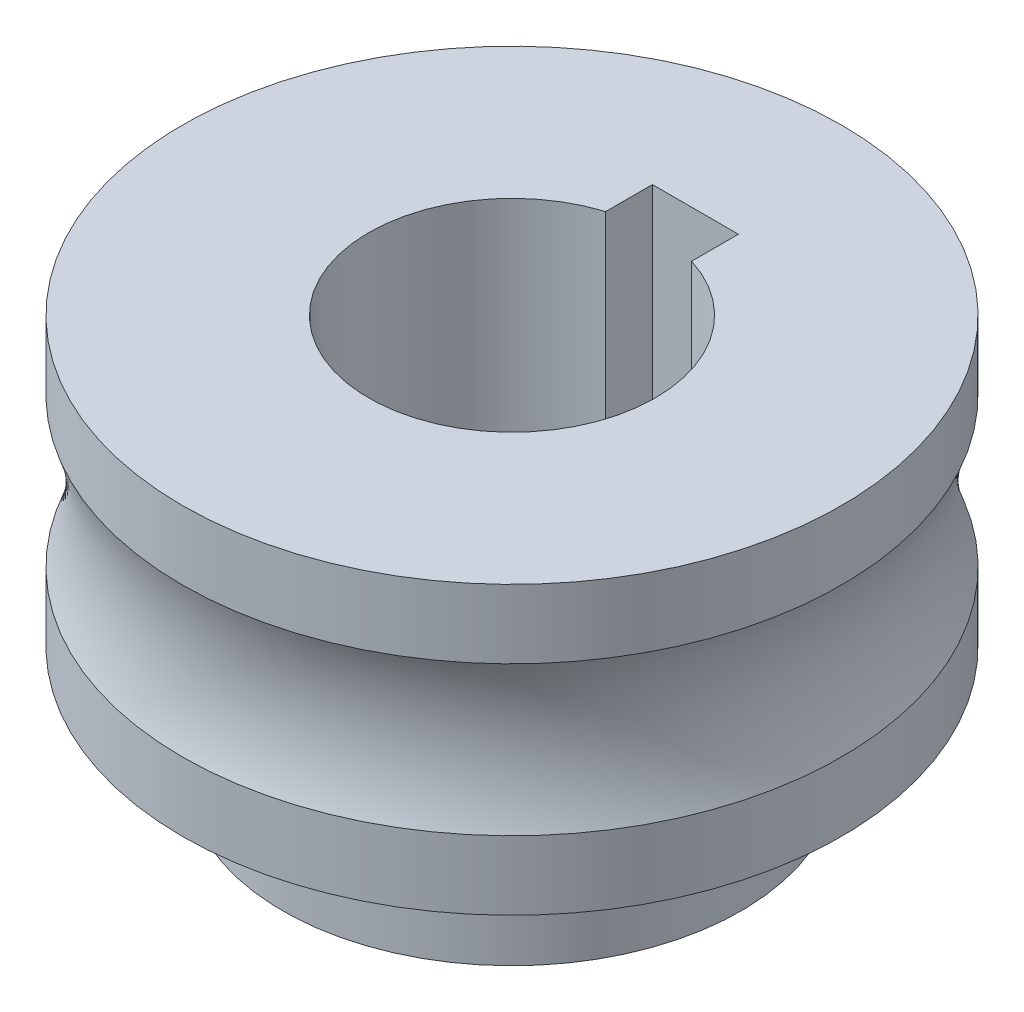
ISO-10303-21;
HEADER;
FILE_DESCRIPTION(('STEP AP214'),'2;1');
FILE_NAME('part.step','',(''),(''),'','','');
FILE_SCHEMA(('AUTOMOTIVE_DESIGN { 1 0 10303 214 1 1 1 1 }'));
ENDSEC;
DATA;
#1=APPLICATION_CONTEXT('core data for automotive mechanical design processes');
#2=APPLICATION_PROTOCOL_DEFINITION('international standard','automotive_design',2000,#1);
#3=PRODUCT_CONTEXT('',#1,'mechanical');
#4=PRODUCT('Part','Part','',(#3));
#5=PRODUCT_RELATED_PRODUCT_CATEGORY('part','',(#4));
#6=PRODUCT_DEFINITION_FORMATION('','',#4);
#7=PRODUCT_DEFINITION_CONTEXT('part definition',#1,'design');
#8=PRODUCT_DEFINITION('design','',#6,#7);
#9=PRODUCT_DEFINITION_SHAPE('','',#8);
#10=(LENGTH_UNIT() NAMED_UNIT(*) SI_UNIT(.MILLI.,.METRE.));
#11=(NAMED_UNIT(*) PLANE_ANGLE_UNIT() SI_UNIT($,.RADIAN.));
#12=(NAMED_UNIT(*) SI_UNIT($,.STERADIAN.) SOLID_ANGLE_UNIT());
#13=UNCERTAINTY_MEASURE_WITH_UNIT(LENGTH_MEASURE(1.E-05),#10,'distance_accuracy_value','');
#14=(GEOMETRIC_REPRESENTATION_CONTEXT(3) GLOBAL_UNCERTAINTY_ASSIGNED_CONTEXT((#13)) GLOBAL_UNIT_ASSIGNED_CONTEXT((#10,
#11,#12)) REPRESENTATION_CONTEXT('',''));
#15=CARTESIAN_POINT('',(0.,0.,0.));
#16=DIRECTION('',(0.,0.,1.));
#17=DIRECTION('',(1.,0.,0.));
#18=AXIS2_PLACEMENT_3D('',#15,#16,#17);
#19=CARTESIAN_POINT('',(0.,-15.,0.));
#20=DIRECTION('',(0.,-1.,0.));
#21=DIRECTION('',(0.,0.,-1.));
#22=AXIS2_PLACEMENT_3D('',#19,#20,#21);
#23=CYLINDRICAL_SURFACE('',#22,5.);
#24=DIRECTION('',(0.,-1.,0.));
#25=VECTOR('',#24,1.);
#26=CARTESIAN_POINT('',(1.5,-15.,-4.76969600708473));
#27=LINE('',#26,#25);
#28=CARTESIAN_POINT('',(1.5,-9.,-4.76969600708473));
#29=VERTEX_POINT('',#28);
#30=CARTESIAN_POINT('',(1.5,5.,-4.76969600708473));
#31=VERTEX_POINT('',#30);
#32=EDGE_CURVE('E69',#29,#31,#27,.F.);
#33=ORIENTED_EDGE('',*,*,#32,.F.);
#34=CARTESIAN_POINT('',(0.,-9.,0.));
#35=DIRECTION('',(0.,-1.,0.));
#36=DIRECTION('',(0.,0.,-1.));
#37=AXIS2_PLACEMENT_3D('',#34,#35,#36);
#38=CIRCLE('',#37,5.);
#39=CARTESIAN_POINT('',(-1.5,-9.,-4.76969600708473));
#40=VERTEX_POINT('',#39);
#41=EDGE_CURVE('E233',#29,#40,#38,.T.);
#42=ORIENTED_EDGE('',*,*,#41,.T.);
#43=DIRECTION('',(0.,-1.,0.));
#44=VECTOR('',#43,1.);
#45=CARTESIAN_POINT('',(-1.5,-15.,-4.76969600708473));
#46=LINE('',#45,#44);
#47=CARTESIAN_POINT('',(-1.5,5.,-4.76969600708473));
#48=VERTEX_POINT('',#47);
#49=EDGE_CURVE('E100',#48,#40,#46,.T.);
#50=ORIENTED_EDGE('',*,*,#49,.F.);
#51=CARTESIAN_POINT('',(0.,5.,0.));
#52=DIRECTION('',(0.,-1.,0.));
#53=DIRECTION('',(0.,0.,-1.));
#54=AXIS2_PLACEMENT_3D('',#51,#52,#53);
#55=CIRCLE('',#54,5.);
#56=EDGE_CURVE('E128',#31,#48,#55,.T.);
#57=ORIENTED_EDGE('',*,*,#56,.F.);
#58=EDGE_LOOP('',(#33,#42,#50,#57));
#59=FACE_BOUND('',#58,.T.);
#60=ADVANCED_FACE('F48',(#59),#23,.F.);
#61=CARTESIAN_POINT('',(0.,-15.,0.));
#62=DIRECTION('',(0.,-1.,0.));
#63=DIRECTION('',(0.,0.,-1.));
#64=AXIS2_PLACEMENT_3D('',#61,#62,#63);
#65=CYLINDRICAL_SURFACE('',#64,8.);
#66=CARTESIAN_POINT('',(0.,-5.,0.));
#67=DIRECTION('',(0.,-1.,0.));
#68=DIRECTION('',(0.,0.,-1.));
#69=AXIS2_PLACEMENT_3D('',#66,#67,#68);
#70=CIRCLE('',#69,8.);
#71=CARTESIAN_POINT('',(0.,-5.,-8.));
#72=VERTEX_POINT('',#71);
#73=EDGE_CURVE('E125',#72,#72,#70,.T.);
#74=ORIENTED_EDGE('',*,*,#73,.T.);
#75=EDGE_LOOP('',(#74));
#76=FACE_BOUND('',#75,.T.);
#77=CARTESIAN_POINT('',(0.,-9.,0.));
#78=DIRECTION('',(0.,-1.,0.));
#79=DIRECTION('',(0.,0.,-1.));
#80=AXIS2_PLACEMENT_3D('',#77,#78,#79);
#81=CIRCLE('',#80,8.);
#82=CARTESIAN_POINT('',(0.,-9.,-8.));
#83=VERTEX_POINT('',#82);
#84=EDGE_CURVE('E101',#83,#83,#81,.F.);
#85=ORIENTED_EDGE('',*,*,#84,.T.);
#86=EDGE_LOOP('',(#85));
#87=FACE_BOUND('',#86,.T.);
#88=ADVANCED_FACE('F148',(#76,#87),#65,.T.);
#89=CARTESIAN_POINT('',(1.5,-15.,-3.6));
#90=DIRECTION('',(1.,0.,0.));
#91=DIRECTION('',(0.,0.,-1.));
#92=AXIS2_PLACEMENT_3D('',#89,#90,#91);
#93=PLANE('',#92);
#94=DIRECTION('',(0.,0.,-1.));
#95=VECTOR('',#94,1.);
#96=CARTESIAN_POINT('',(1.5,-9.,-3.6));
#97=LINE('',#96,#95);
#98=CARTESIAN_POINT('',(1.5,-9.,-6.4));
#99=VERTEX_POINT('',#98);
#100=EDGE_CURVE('E62',#29,#99,#97,.T.);
#101=ORIENTED_EDGE('',*,*,#100,.F.);
#102=ORIENTED_EDGE('',*,*,#32,.T.);
#103=DIRECTION('',(0.,0.,-1.));
#104=VECTOR('',#103,1.);
#105=CARTESIAN_POINT('',(1.5,5.,-3.6));
#106=LINE('',#105,#104);
#107=CARTESIAN_POINT('',(1.5,5.,-6.4));
#108=VERTEX_POINT('',#107);
#109=EDGE_CURVE('E236',#31,#108,#106,.T.);
#110=ORIENTED_EDGE('',*,*,#109,.T.);
#111=DIRECTION('',(0.,1.,0.));
#112=VECTOR('',#111,1.);
#113=CARTESIAN_POINT('',(1.5,-15.,-6.4));
#114=LINE('',#113,#112);
#115=EDGE_CURVE('E107',#99,#108,#114,.T.);
#116=ORIENTED_EDGE('',*,*,#115,.F.);
#117=EDGE_LOOP('',(#101,#102,#110,#116));
#118=FACE_BOUND('',#117,.T.);
#119=ADVANCED_FACE('F153',(#118),#93,.F.);
#120=CARTESIAN_POINT('',(-1.5,-15.,-3.6));
#121=DIRECTION('',(-1.,0.,0.));
#122=DIRECTION('',(0.,0.,1.));
#123=AXIS2_PLACEMENT_3D('',#120,#121,#122);
#124=PLANE('',#123);
#125=DIRECTION('',(0.,0.,1.));
#126=VECTOR('',#125,1.);
#127=CARTESIAN_POINT('',(-1.5,-9.,-3.6));
#128=LINE('',#127,#126);
#129=CARTESIAN_POINT('',(-1.5,-9.,-6.4));
#130=VERTEX_POINT('',#129);
#131=EDGE_CURVE('E89',#130,#40,#128,.T.);
#132=ORIENTED_EDGE('',*,*,#131,.F.);
#133=DIRECTION('',(0.,1.,0.));
#134=VECTOR('',#133,1.);
#135=CARTESIAN_POINT('',(-1.5,-15.,-6.4));
#136=LINE('',#135,#134);
#137=CARTESIAN_POINT('',(-1.5,5.,-6.4));
#138=VERTEX_POINT('',#137);
#139=EDGE_CURVE('E97',#130,#138,#136,.T.);
#140=ORIENTED_EDGE('',*,*,#139,.T.);
#141=DIRECTION('',(0.,0.,1.));
#142=VECTOR('',#141,1.);
#143=CARTESIAN_POINT('',(-1.5,5.,-3.6));
#144=LINE('',#143,#142);
#145=EDGE_CURVE('E110',#138,#48,#144,.T.);
#146=ORIENTED_EDGE('',*,*,#145,.T.);
#147=ORIENTED_EDGE('',*,*,#49,.T.);
#148=EDGE_LOOP('',(#132,#140,#146,#147));
#149=FACE_BOUND('',#148,.T.);
#150=ADVANCED_FACE('F96',(#149),#124,.F.);
#151=CARTESIAN_POINT('',(-1.5,-15.,-6.4));
#152=DIRECTION('',(0.,0.,-1.));
#153=DIRECTION('',(-1.,0.,0.));
#154=AXIS2_PLACEMENT_3D('',#151,#152,#153);
#155=PLANE('',#154);
#156=DIRECTION('',(-1.,0.,0.));
#157=VECTOR('',#156,1.);
#158=CARTESIAN_POINT('',(-1.5,-9.,-6.4));
#159=LINE('',#158,#157);
#160=EDGE_CURVE('E15',#99,#130,#159,.T.);
#161=ORIENTED_EDGE('',*,*,#160,.F.);
#162=ORIENTED_EDGE('',*,*,#115,.T.);
#163=DIRECTION('',(-1.,0.,0.));
#164=VECTOR('',#163,1.);
#165=CARTESIAN_POINT('',(-1.5,5.,-6.4));
#166=LINE('',#165,#164);
#167=EDGE_CURVE('E105',#108,#138,#166,.T.);
#168=ORIENTED_EDGE('',*,*,#167,.T.);
#169=ORIENTED_EDGE('',*,*,#139,.F.);
#170=EDGE_LOOP('',(#161,#162,#168,#169));
#171=FACE_BOUND('',#170,.T.);
#172=ADVANCED_FACE('F103',(#171),#155,.F.);
#173=CARTESIAN_POINT('',(0.,-15.,0.));
#174=DIRECTION('',(0.,-1.,0.));
#175=DIRECTION('',(0.,0.,-1.));
#176=AXIS2_PLACEMENT_3D('',#173,#174,#175);
#177=CYLINDRICAL_SURFACE('',#176,11.5);
#178=CARTESIAN_POINT('',(0.,5.,0.));
#179=DIRECTION('',(0.,-1.,0.));
#180=DIRECTION('',(0.,0.,-1.));
#181=AXIS2_PLACEMENT_3D('',#178,#179,#180);
#182=CIRCLE('',#181,11.5);
#183=CARTESIAN_POINT('',(0.,5.,-11.5));
#184=VERTEX_POINT('',#183);
#185=EDGE_CURVE('E56',#184,#184,#182,.T.);
#186=ORIENTED_EDGE('',*,*,#185,.T.);
#187=EDGE_LOOP('',(#186));
#188=FACE_BOUND('',#187,.T.);
#189=CARTESIAN_POINT('',(0.,2.59807621135331,0.));
#190=DIRECTION('',(0.,-1.,0.));
#191=DIRECTION('',(0.,0.,-1.));
#192=AXIS2_PLACEMENT_3D('',#189,#190,#191);
#193=CIRCLE('',#192,11.5);
#194=CARTESIAN_POINT('',(0.,2.59807621135331,-11.5));
#195=VERTEX_POINT('',#194);
#196=EDGE_CURVE('E116',#195,#195,#193,.T.);
#197=ORIENTED_EDGE('',*,*,#196,.F.);
#198=EDGE_LOOP('',(#197));
#199=FACE_BOUND('',#198,.T.);
#200=ADVANCED_FACE('F50',(#188,#199),#177,.T.);
#201=CARTESIAN_POINT('',(11.5,5.,0.));
#202=DIRECTION('',(0.,1.,0.));
#203=DIRECTION('',(0.,0.,1.));
#204=AXIS2_PLACEMENT_3D('',#201,#202,#203);
#205=PLANE('',#204);
#206=ORIENTED_EDGE('',*,*,#109,.F.);
#207=ORIENTED_EDGE('',*,*,#56,.T.);
#208=ORIENTED_EDGE('',*,*,#145,.F.);
#209=ORIENTED_EDGE('',*,*,#167,.F.);
#210=EDGE_LOOP('',(#206,#207,#208,#209));
#211=FACE_BOUND('',#210,.T.);
#212=ORIENTED_EDGE('',*,*,#185,.F.);
#213=EDGE_LOOP('',(#212));
#214=FACE_BOUND('',#213,.T.);
#215=ADVANCED_FACE('F135',(#211,#214),#205,.T.);
#216=CARTESIAN_POINT('',(8.,-5.,0.));
#217=DIRECTION('',(0.,-1.,0.));
#218=DIRECTION('',(0.,0.,-1.));
#219=AXIS2_PLACEMENT_3D('',#216,#217,#218);
#220=PLANE('',#219);
#221=CARTESIAN_POINT('',(0.,-5.,0.));
#222=DIRECTION('',(0.,-1.,0.));
#223=DIRECTION('',(0.,0.,-1.));
#224=AXIS2_PLACEMENT_3D('',#221,#222,#223);
#225=CIRCLE('',#224,11.5);
#226=CARTESIAN_POINT('',(0.,-5.,-11.5));
#227=VERTEX_POINT('',#226);
#228=EDGE_CURVE('E122',#227,#227,#225,.T.);
#229=ORIENTED_EDGE('',*,*,#228,.T.);
#230=EDGE_LOOP('',(#229));
#231=FACE_BOUND('',#230,.T.);
#232=ORIENTED_EDGE('',*,*,#73,.F.);
#233=EDGE_LOOP('',(#232));
#234=FACE_BOUND('',#233,.T.);
#235=ADVANCED_FACE('F137',(#231,#234),#220,.T.);
#236=CARTESIAN_POINT('',(0.,-15.,0.));
#237=DIRECTION('',(0.,-1.,0.));
#238=DIRECTION('',(0.,0.,-1.));
#239=AXIS2_PLACEMENT_3D('',#236,#237,#238);
#240=CYLINDRICAL_SURFACE('',#239,11.5);
#241=CARTESIAN_POINT('',(0.,-2.5980762113533,0.));
#242=DIRECTION('',(0.,-1.,0.));
#243=DIRECTION('',(0.,0.,-1.));
#244=AXIS2_PLACEMENT_3D('',#241,#242,#243);
#245=CIRCLE('',#244,11.5);
#246=CARTESIAN_POINT('',(0.,-2.5980762113533,-11.5));
#247=VERTEX_POINT('',#246);
#248=EDGE_CURVE('E119',#247,#247,#245,.T.);
#249=ORIENTED_EDGE('',*,*,#248,.T.);
#250=EDGE_LOOP('',(#249));
#251=FACE_BOUND('',#250,.T.);
#252=ORIENTED_EDGE('',*,*,#228,.F.);
#253=EDGE_LOOP('',(#252));
#254=FACE_BOUND('',#253,.T.);
#255=ADVANCED_FACE('F143',(#251,#254),#240,.T.);
#256=CARTESIAN_POINT('',(0.,0.,0.));
#257=DIRECTION('',(0.,-1.,0.));
#258=DIRECTION('',(0.,0.,-1.));
#259=AXIS2_PLACEMENT_3D('',#256,#257,#258);
#260=TOROIDAL_SURFACE('',#259,18.,7.);
#261=ORIENTED_EDGE('',*,*,#248,.F.);
#262=EDGE_LOOP('',(#261));
#263=FACE_BOUND('',#262,.T.);
#264=ORIENTED_EDGE('',*,*,#196,.T.);
#265=EDGE_LOOP('',(#264));
#266=FACE_BOUND('',#265,.T.);
#267=ADVANCED_FACE('F159',(#263,#266),#260,.F.);
#268=CARTESIAN_POINT('',(8.,-9.,0.));
#269=DIRECTION('',(0.,-1.,0.));
#270=DIRECTION('',(0.,0.,-1.));
#271=AXIS2_PLACEMENT_3D('',#268,#269,#270);
#272=PLANE('',#271);
#273=ORIENTED_EDGE('',*,*,#100,.T.);
#274=ORIENTED_EDGE('',*,*,#160,.T.);
#275=ORIENTED_EDGE('',*,*,#131,.T.);
#276=ORIENTED_EDGE('',*,*,#41,.F.);
#277=EDGE_LOOP('',(#273,#274,#275,#276));
#278=FACE_BOUND('',#277,.T.);
#279=ORIENTED_EDGE('',*,*,#84,.F.);
#280=EDGE_LOOP('',(#279));
#281=FACE_BOUND('',#280,.T.);
#282=ADVANCED_FACE('F87',(#278,#281),#272,.T.);
#283=CLOSED_SHELL('',(#60,#88,#119,#150,#172,#200,#215,#235,#255,#267,#282));
#284=MANIFOLD_SOLID_BREP('B2',#283);
#285=ADVANCED_BREP_SHAPE_REPRESENTATION('',(#18,#284),#14);
#286=SHAPE_DEFINITION_REPRESENTATION(#9,#285);
ENDSEC;
END-ISO-10303-21;
